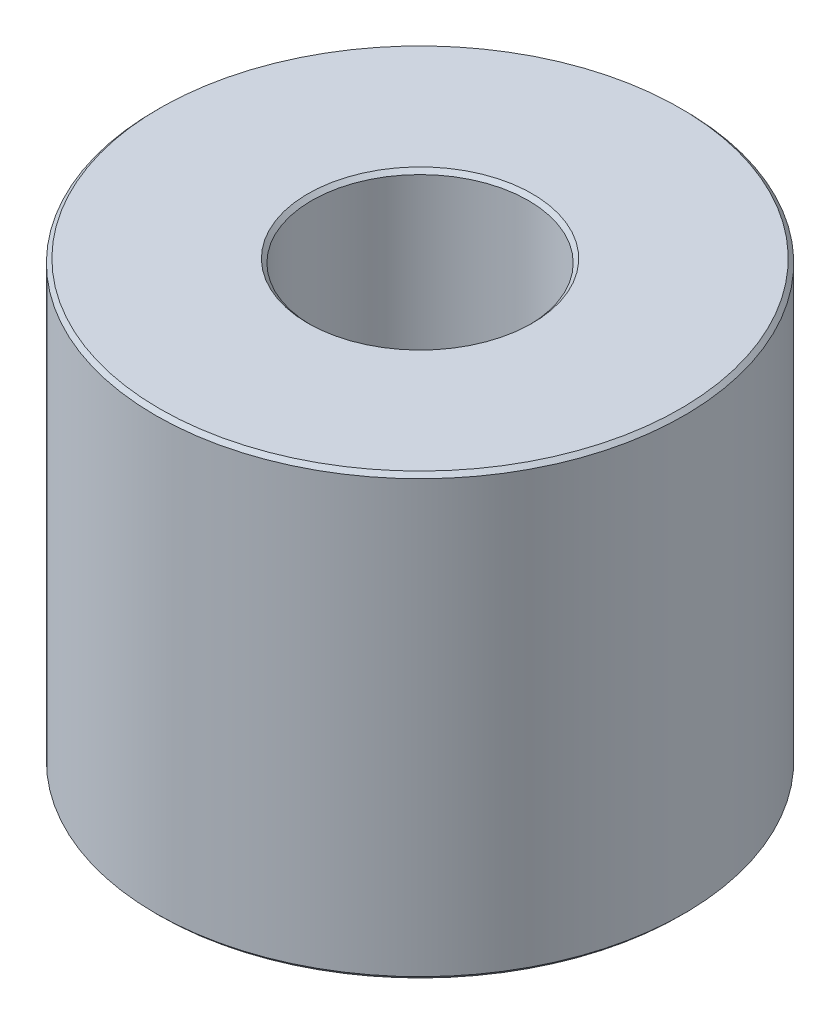
ISO-10303-21;
HEADER;
FILE_DESCRIPTION(('STEP AP214'),'2;1');
FILE_NAME('part.step','',(''),(''),'','','');
FILE_SCHEMA(('AUTOMOTIVE_DESIGN { 1 0 10303 214 1 1 1 1 }'));
ENDSEC;
DATA;
#1=APPLICATION_CONTEXT('core data for automotive mechanical design processes');
#2=APPLICATION_PROTOCOL_DEFINITION('international standard','automotive_design',2000,#1);
#3=PRODUCT_CONTEXT('',#1,'mechanical');
#4=PRODUCT('Part','Part','',(#3));
#5=PRODUCT_RELATED_PRODUCT_CATEGORY('part','',(#4));
#6=PRODUCT_DEFINITION_FORMATION('','',#4);
#7=PRODUCT_DEFINITION_CONTEXT('part definition',#1,'design');
#8=PRODUCT_DEFINITION('design','',#6,#7);
#9=PRODUCT_DEFINITION_SHAPE('','',#8);
#10=(LENGTH_UNIT() NAMED_UNIT(*) SI_UNIT(.MILLI.,.METRE.));
#11=(NAMED_UNIT(*) PLANE_ANGLE_UNIT() SI_UNIT($,.RADIAN.));
#12=(NAMED_UNIT(*) SI_UNIT($,.STERADIAN.) SOLID_ANGLE_UNIT());
#13=UNCERTAINTY_MEASURE_WITH_UNIT(LENGTH_MEASURE(1.E-05),#10,'distance_accuracy_value','');
#14=(GEOMETRIC_REPRESENTATION_CONTEXT(3) GLOBAL_UNCERTAINTY_ASSIGNED_CONTEXT((#13)) GLOBAL_UNIT_ASSIGNED_CONTEXT((#10,
#11,#12)) REPRESENTATION_CONTEXT('',''));
#15=CARTESIAN_POINT('',(0.,0.,0.));
#16=DIRECTION('',(0.,0.,1.));
#17=DIRECTION('',(1.,0.,0.));
#18=AXIS2_PLACEMENT_3D('',#15,#16,#17);
#19=CARTESIAN_POINT('',(0.,29.0743140752812,0.));
#20=DIRECTION('',(0.,-1.,0.));
#21=DIRECTION('',(0.,0.,-1.));
#22=AXIS2_PLACEMENT_3D('',#19,#20,#21);
#23=CYLINDRICAL_SURFACE('',#22,17.5);
#24=CARTESIAN_POINT('',(0.,0.257517710811894,0.));
#25=DIRECTION('',(0.,1.,0.));
#26=DIRECTION('',(0.,0.,1.));
#27=AXIS2_PLACEMENT_3D('',#24,#25,#26);
#28=CIRCLE('',#27,17.5);
#29=CARTESIAN_POINT('',(0.,0.257517710811894,17.5));
#30=VERTEX_POINT('',#29);
#31=EDGE_CURVE('E10',#30,#30,#28,.T.);
#32=ORIENTED_EDGE('',*,*,#31,.T.);
#33=EDGE_LOOP('',(#32));
#34=FACE_BOUND('',#33,.T.);
#35=CARTESIAN_POINT('',(0.,28.8167963644693,0.));
#36=DIRECTION('',(0.,1.,0.));
#37=DIRECTION('',(0.,0.,1.));
#38=AXIS2_PLACEMENT_3D('',#35,#36,#37);
#39=CIRCLE('',#38,17.5);
#40=CARTESIAN_POINT('',(0.,28.8167963644693,17.5));
#41=VERTEX_POINT('',#40);
#42=EDGE_CURVE('E50',#41,#41,#39,.F.);
#43=ORIENTED_EDGE('',*,*,#42,.T.);
#44=EDGE_LOOP('',(#43));
#45=FACE_BOUND('',#44,.T.);
#46=ADVANCED_FACE('F39',(#34,#45),#23,.T.);
#47=CARTESIAN_POINT('',(0.,29.0743140752812,0.));
#48=DIRECTION('',(0.,1.,0.));
#49=DIRECTION('',(0.,0.,1.));
#50=AXIS2_PLACEMENT_3D('',#47,#48,#49);
#51=PLANE('',#50);
#52=CARTESIAN_POINT('',(0.,29.0743140752812,0.));
#53=DIRECTION('',(0.,1.,0.));
#54=DIRECTION('',(0.,0.,1.));
#55=AXIS2_PLACEMENT_3D('',#52,#53,#54);
#56=CIRCLE('',#55,7.43112264511796);
#57=CARTESIAN_POINT('',(0.,29.0743140752812,7.43112264511796));
#58=VERTEX_POINT('',#57);
#59=EDGE_CURVE('E58',#58,#58,#56,.F.);
#60=ORIENTED_EDGE('',*,*,#59,.T.);
#61=EDGE_LOOP('',(#60));
#62=FACE_BOUND('',#61,.T.);
#63=CARTESIAN_POINT('',(0.,29.0743140752812,0.));
#64=DIRECTION('',(0.,1.,0.));
#65=DIRECTION('',(0.,0.,1.));
#66=AXIS2_PLACEMENT_3D('',#63,#64,#65);
#67=CIRCLE('',#66,17.2424822891881);
#68=CARTESIAN_POINT('',(0.,29.0743140752812,17.2424822891881));
#69=VERTEX_POINT('',#68);
#70=EDGE_CURVE('E61',#69,#69,#67,.T.);
#71=ORIENTED_EDGE('',*,*,#70,.T.);
#72=EDGE_LOOP('',(#71));
#73=FACE_BOUND('',#72,.T.);
#74=ADVANCED_FACE('F88',(#62,#73),#51,.T.);
#75=CARTESIAN_POINT('',(0.,0.,0.));
#76=DIRECTION('',(0.,1.,0.));
#77=DIRECTION('',(0.,0.,1.));
#78=AXIS2_PLACEMENT_3D('',#75,#76,#77);
#79=PLANE('',#78);
#80=CARTESIAN_POINT('',(0.,0.,0.));
#81=DIRECTION('',(0.,1.,0.));
#82=DIRECTION('',(0.,0.,1.));
#83=AXIS2_PLACEMENT_3D('',#80,#81,#82);
#84=CIRCLE('',#83,7.43112264511798);
#85=CARTESIAN_POINT('',(0.,0.,7.43112264511798));
#86=VERTEX_POINT('',#85);
#87=EDGE_CURVE('E51',#86,#86,#84,.T.);
#88=ORIENTED_EDGE('',*,*,#87,.T.);
#89=EDGE_LOOP('',(#88));
#90=FACE_BOUND('',#89,.T.);
#91=CARTESIAN_POINT('',(0.,0.,0.));
#92=DIRECTION('',(0.,1.,0.));
#93=DIRECTION('',(0.,0.,1.));
#94=AXIS2_PLACEMENT_3D('',#91,#92,#93);
#95=CIRCLE('',#94,17.2424822891881);
#96=CARTESIAN_POINT('',(0.,0.,17.2424822891881));
#97=VERTEX_POINT('',#96);
#98=EDGE_CURVE('E54',#97,#97,#95,.F.);
#99=ORIENTED_EDGE('',*,*,#98,.T.);
#100=EDGE_LOOP('',(#99));
#101=FACE_BOUND('',#100,.T.);
#102=ADVANCED_FACE('F83',(#90,#101),#79,.F.);
#103=CARTESIAN_POINT('',(0.,29.0743140752812,0.));
#104=DIRECTION('',(0.,-1.,0.));
#105=DIRECTION('',(0.,0.,-1.));
#106=AXIS2_PLACEMENT_3D('',#103,#104,#105);
#107=CYLINDRICAL_SURFACE('',#106,7.17360493430608);
#108=CARTESIAN_POINT('',(0.,28.8167963644694,0.));
#109=DIRECTION('',(0.,1.,0.));
#110=DIRECTION('',(0.,0.,1.));
#111=AXIS2_PLACEMENT_3D('',#108,#109,#110);
#112=CIRCLE('',#111,7.17360493430608);
#113=CARTESIAN_POINT('',(0.,28.8167963644694,7.17360493430608));
#114=VERTEX_POINT('',#113);
#115=EDGE_CURVE('E67',#114,#114,#112,.T.);
#116=ORIENTED_EDGE('',*,*,#115,.T.);
#117=EDGE_LOOP('',(#116));
#118=FACE_BOUND('',#117,.T.);
#119=CARTESIAN_POINT('',(0.,0.257517710811887,0.));
#120=DIRECTION('',(0.,1.,0.));
#121=DIRECTION('',(0.,0.,1.));
#122=AXIS2_PLACEMENT_3D('',#119,#120,#121);
#123=CIRCLE('',#122,7.17360493430608);
#124=CARTESIAN_POINT('',(0.,0.257517710811887,7.17360493430608));
#125=VERTEX_POINT('',#124);
#126=EDGE_CURVE('E69',#125,#125,#123,.F.);
#127=ORIENTED_EDGE('',*,*,#126,.T.);
#128=EDGE_LOOP('',(#127));
#129=FACE_BOUND('',#128,.T.);
#130=ADVANCED_FACE('F71',(#118,#129),#107,.F.);
#131=CARTESIAN_POINT('',(0.,28.8167963644694,0.));
#132=DIRECTION('',(0.,1.,0.));
#133=DIRECTION('',(0.,0.,1.));
#134=AXIS2_PLACEMENT_3D('',#131,#132,#133);
#135=CONICAL_SURFACE('',#134,7.17360493430608,0.785398163397448);
#136=ORIENTED_EDGE('',*,*,#59,.F.);
#137=EDGE_LOOP('',(#136));
#138=FACE_BOUND('',#137,.T.);
#139=ORIENTED_EDGE('',*,*,#115,.F.);
#140=EDGE_LOOP('',(#139));
#141=FACE_BOUND('',#140,.T.);
#142=ADVANCED_FACE('F77',(#138,#141),#135,.F.);
#143=CARTESIAN_POINT('',(0.,0.,0.));
#144=DIRECTION('',(0.,-1.,0.));
#145=DIRECTION('',(0.,0.,-1.));
#146=AXIS2_PLACEMENT_3D('',#143,#144,#145);
#147=CONICAL_SURFACE('',#146,7.43112264511798,0.785398163397462);
#148=ORIENTED_EDGE('',*,*,#126,.F.);
#149=EDGE_LOOP('',(#148));
#150=FACE_BOUND('',#149,.T.);
#151=ORIENTED_EDGE('',*,*,#87,.F.);
#152=EDGE_LOOP('',(#151));
#153=FACE_BOUND('',#152,.T.);
#154=ADVANCED_FACE('F73',(#150,#153),#147,.F.);
#155=CARTESIAN_POINT('',(0.,0.257517710811894,0.));
#156=DIRECTION('',(0.,1.,0.));
#157=DIRECTION('',(0.,0.,1.));
#158=AXIS2_PLACEMENT_3D('',#155,#156,#157);
#159=CONICAL_SURFACE('',#158,17.5,0.785398163397462);
#160=ORIENTED_EDGE('',*,*,#98,.F.);
#161=EDGE_LOOP('',(#160));
#162=FACE_BOUND('',#161,.T.);
#163=ORIENTED_EDGE('',*,*,#31,.F.);
#164=EDGE_LOOP('',(#163));
#165=FACE_BOUND('',#164,.T.);
#166=ADVANCED_FACE('F76',(#162,#165),#159,.T.);
#167=CARTESIAN_POINT('',(0.,29.0743140752812,0.));
#168=DIRECTION('',(0.,-1.,0.));
#169=DIRECTION('',(0.,0.,-1.));
#170=AXIS2_PLACEMENT_3D('',#167,#168,#169);
#171=CONICAL_SURFACE('',#170,17.2424822891881,0.785398163397448);
#172=ORIENTED_EDGE('',*,*,#42,.F.);
#173=EDGE_LOOP('',(#172));
#174=FACE_BOUND('',#173,.T.);
#175=ORIENTED_EDGE('',*,*,#70,.F.);
#176=EDGE_LOOP('',(#175));
#177=FACE_BOUND('',#176,.T.);
#178=ADVANCED_FACE('F45',(#174,#177),#171,.T.);
#179=CLOSED_SHELL('',(#46,#74,#102,#130,#142,#154,#166,#178));
#180=MANIFOLD_SOLID_BREP('B2',#179);
#181=ADVANCED_BREP_SHAPE_REPRESENTATION('',(#18,#180),#14);
#182=SHAPE_DEFINITION_REPRESENTATION(#9,#181);
ENDSEC;
END-ISO-10303-21;
